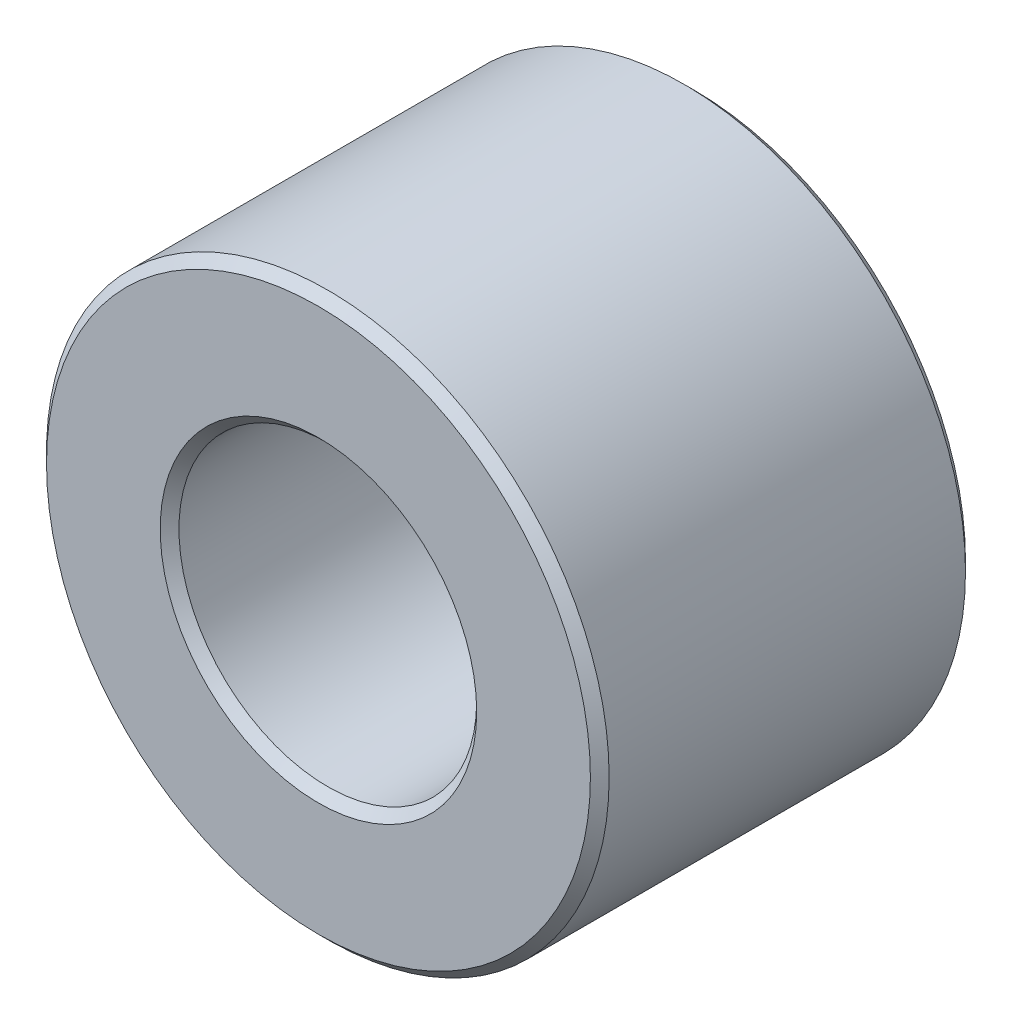
ISO-10303-21;
HEADER;
FILE_DESCRIPTION(('STEP AP214'),'2;1');
FILE_NAME('part.step','',(''),(''),'','','');
FILE_SCHEMA(('AUTOMOTIVE_DESIGN { 1 0 10303 214 1 1 1 1 }'));
ENDSEC;
DATA;
#1=APPLICATION_CONTEXT('core data for automotive mechanical design processes');
#2=APPLICATION_PROTOCOL_DEFINITION('international standard','automotive_design',2000,#1);
#3=PRODUCT_CONTEXT('',#1,'mechanical');
#4=PRODUCT('Part','Part','',(#3));
#5=PRODUCT_RELATED_PRODUCT_CATEGORY('part','',(#4));
#6=PRODUCT_DEFINITION_FORMATION('','',#4);
#7=PRODUCT_DEFINITION_CONTEXT('part definition',#1,'design');
#8=PRODUCT_DEFINITION('design','',#6,#7);
#9=PRODUCT_DEFINITION_SHAPE('','',#8);
#10=(LENGTH_UNIT() NAMED_UNIT(*) SI_UNIT(.MILLI.,.METRE.));
#11=(NAMED_UNIT(*) PLANE_ANGLE_UNIT() SI_UNIT($,.RADIAN.));
#12=(NAMED_UNIT(*) SI_UNIT($,.STERADIAN.) SOLID_ANGLE_UNIT());
#13=UNCERTAINTY_MEASURE_WITH_UNIT(LENGTH_MEASURE(1.E-05),#10,'distance_accuracy_value','');
#14=(GEOMETRIC_REPRESENTATION_CONTEXT(3) GLOBAL_UNCERTAINTY_ASSIGNED_CONTEXT((#13)) GLOBAL_UNIT_ASSIGNED_CONTEXT((#10,
#11,#12)) REPRESENTATION_CONTEXT('',''));
#15=CARTESIAN_POINT('',(0.,0.,0.));
#16=DIRECTION('',(0.,0.,1.));
#17=DIRECTION('',(1.,0.,0.));
#18=AXIS2_PLACEMENT_3D('',#15,#16,#17);
#19=CARTESIAN_POINT('',(0.,-1.65592377923915E-12,-1.05000000000006));
#20=DIRECTION('',(0.,0.,-1.));
#21=DIRECTION('',(0.,1.,0.));
#22=AXIS2_PLACEMENT_3D('',#19,#20,#21);
#23=CONICAL_SURFACE('',#22,2.95,0.785398163397491);
#24=CARTESIAN_POINT('',(0.,-1.65599638237972E-12,-1.00000000000007));
#25=DIRECTION('',(0.,0.,-1.));
#26=DIRECTION('',(1.,0.,0.));
#27=AXIS2_PLACEMENT_3D('',#24,#25,#26);
#28=CIRCLE('',#27,2.9);
#29=CARTESIAN_POINT('',(2.9,-1.65599638237972E-12,-1.00000000000007));
#30=VERTEX_POINT('',#29);
#31=EDGE_CURVE('E10',#30,#30,#28,.T.);
#32=ORIENTED_EDGE('',*,*,#31,.T.);
#33=EDGE_LOOP('',(#32));
#34=FACE_BOUND('',#33,.T.);
#35=CARTESIAN_POINT('',(0.,-1.65585117609857E-12,-1.10000000000006));
#36=DIRECTION('',(0.,0.,-1.));
#37=DIRECTION('',(1.,0.,0.));
#38=AXIS2_PLACEMENT_3D('',#35,#36,#37);
#39=CIRCLE('',#38,3.);
#40=CARTESIAN_POINT('',(3.,-1.65585117609857E-12,-1.10000000000006));
#41=VERTEX_POINT('',#40);
#42=EDGE_CURVE('E39',#41,#41,#39,.T.);
#43=ORIENTED_EDGE('',*,*,#42,.F.);
#44=EDGE_LOOP('',(#43));
#45=FACE_BOUND('',#44,.T.);
#46=ADVANCED_FACE('F15',(#34,#45),#23,.T.);
#47=CARTESIAN_POINT('',(0.,2.89999999999835,-1.00000000000006));
#48=DIRECTION('',(0.,0.,1.));
#49=DIRECTION('',(0.,-1.,0.));
#50=AXIS2_PLACEMENT_3D('',#47,#48,#49);
#51=PLANE('',#50);
#52=CARTESIAN_POINT('',(0.,-1.65599638237972E-12,-1.00000000000007));
#53=DIRECTION('',(0.,0.,-1.));
#54=DIRECTION('',(1.,0.,0.));
#55=AXIS2_PLACEMENT_3D('',#52,#53,#54);
#56=CIRCLE('',#55,1.6875);
#57=CARTESIAN_POINT('',(1.6875,-1.65599638237972E-12,-1.00000000000007));
#58=VERTEX_POINT('',#57);
#59=EDGE_CURVE('E23',#58,#58,#56,.T.);
#60=ORIENTED_EDGE('',*,*,#59,.T.);
#61=EDGE_LOOP('',(#60));
#62=FACE_BOUND('',#61,.T.);
#63=ORIENTED_EDGE('',*,*,#31,.F.);
#64=EDGE_LOOP('',(#63));
#65=FACE_BOUND('',#64,.T.);
#66=ADVANCED_FACE('F17',(#62,#65),#51,.T.);
#67=CARTESIAN_POINT('',(0.,-1.65592377923915E-12,-1.05000000000007));
#68=DIRECTION('',(0.,0.,1.));
#69=DIRECTION('',(0.,1.,0.));
#70=AXIS2_PLACEMENT_3D('',#67,#68,#69);
#71=CONICAL_SURFACE('',#70,1.6375,0.78539816339745);
#72=ORIENTED_EDGE('',*,*,#59,.F.);
#73=EDGE_LOOP('',(#72));
#74=FACE_BOUND('',#73,.T.);
#75=CARTESIAN_POINT('',(0.,-1.65585117609857E-12,-1.10000000000006));
#76=DIRECTION('',(0.,0.,-1.));
#77=DIRECTION('',(1.,0.,0.));
#78=AXIS2_PLACEMENT_3D('',#75,#76,#77);
#79=CIRCLE('',#78,1.5875);
#80=CARTESIAN_POINT('',(1.5875,-1.65585117609857E-12,-1.10000000000006));
#81=VERTEX_POINT('',#80);
#82=EDGE_CURVE('E32',#81,#81,#79,.T.);
#83=ORIENTED_EDGE('',*,*,#82,.T.);
#84=EDGE_LOOP('',(#83));
#85=FACE_BOUND('',#84,.T.);
#86=ADVANCED_FACE('F84',(#74,#85),#71,.F.);
#87=CARTESIAN_POINT('',(0.,-1.65447171642765E-12,-2.05000000000007));
#88=DIRECTION('',(0.,0.,-1.));
#89=DIRECTION('',(0.,1.,0.));
#90=AXIS2_PLACEMENT_3D('',#87,#88,#89);
#91=CYLINDRICAL_SURFACE('',#90,1.5875);
#92=ORIENTED_EDGE('',*,*,#82,.F.);
#93=EDGE_LOOP('',(#92));
#94=FACE_BOUND('',#93,.T.);
#95=CARTESIAN_POINT('',(0.,-1.65033333741488E-12,-4.90000000000007));
#96=DIRECTION('',(0.,0.,-1.));
#97=DIRECTION('',(1.,0.,0.));
#98=AXIS2_PLACEMENT_3D('',#95,#96,#97);
#99=CIRCLE('',#98,1.5875);
#100=CARTESIAN_POINT('',(1.5875,-1.65033333741488E-12,-4.90000000000007));
#101=VERTEX_POINT('',#100);
#102=EDGE_CURVE('E54',#101,#101,#99,.T.);
#103=ORIENTED_EDGE('',*,*,#102,.T.);
#104=EDGE_LOOP('',(#103));
#105=FACE_BOUND('',#104,.T.);
#106=ADVANCED_FACE('F64',(#94,#105),#91,.F.);
#107=CARTESIAN_POINT('',(0.,-1.65447171642765E-12,-2.05000000000006));
#108=DIRECTION('',(0.,0.,-1.));
#109=DIRECTION('',(0.,1.,0.));
#110=AXIS2_PLACEMENT_3D('',#107,#108,#109);
#111=CYLINDRICAL_SURFACE('',#110,3.);
#112=ORIENTED_EDGE('',*,*,#42,.T.);
#113=EDGE_LOOP('',(#112));
#114=FACE_BOUND('',#113,.T.);
#115=CARTESIAN_POINT('',(0.,-1.65033333741488E-12,-4.90000000000007));
#116=DIRECTION('',(0.,0.,-1.));
#117=DIRECTION('',(1.,0.,0.));
#118=AXIS2_PLACEMENT_3D('',#115,#116,#117);
#119=CIRCLE('',#118,3.);
#120=CARTESIAN_POINT('',(3.,-1.65033333741488E-12,-4.90000000000007));
#121=VERTEX_POINT('',#120);
#122=EDGE_CURVE('E42',#121,#121,#119,.T.);
#123=ORIENTED_EDGE('',*,*,#122,.F.);
#124=EDGE_LOOP('',(#123));
#125=FACE_BOUND('',#124,.T.);
#126=ADVANCED_FACE('F88',(#114,#125),#111,.T.);
#127=CARTESIAN_POINT('',(0.,-1.6502607342743E-12,-4.95000000000007));
#128=DIRECTION('',(0.,0.,1.));
#129=DIRECTION('',(0.,1.,0.));
#130=AXIS2_PLACEMENT_3D('',#127,#128,#129);
#131=CONICAL_SURFACE('',#130,2.95,0.785398163397491);
#132=CARTESIAN_POINT('',(0.,-1.65018813113373E-12,-5.00000000000006));
#133=DIRECTION('',(0.,0.,-1.));
#134=DIRECTION('',(1.,0.,0.));
#135=AXIS2_PLACEMENT_3D('',#132,#133,#134);
#136=CIRCLE('',#135,2.9);
#137=CARTESIAN_POINT('',(2.9,-1.65018813113373E-12,-5.00000000000006));
#138=VERTEX_POINT('',#137);
#139=EDGE_CURVE('E46',#138,#138,#136,.T.);
#140=ORIENTED_EDGE('',*,*,#139,.F.);
#141=EDGE_LOOP('',(#140));
#142=FACE_BOUND('',#141,.T.);
#143=ORIENTED_EDGE('',*,*,#122,.T.);
#144=EDGE_LOOP('',(#143));
#145=FACE_BOUND('',#144,.T.);
#146=ADVANCED_FACE('F75',(#142,#145),#131,.T.);
#147=CARTESIAN_POINT('',(0.,2.89999999999836,-5.00000000000006));
#148=DIRECTION('',(0.,0.,1.));
#149=DIRECTION('',(0.,-1.,0.));
#150=AXIS2_PLACEMENT_3D('',#147,#148,#149);
#151=PLANE('',#150);
#152=CARTESIAN_POINT('',(0.,-1.65018813113373E-12,-5.00000000000006));
#153=DIRECTION('',(0.,0.,-1.));
#154=DIRECTION('',(1.,0.,0.));
#155=AXIS2_PLACEMENT_3D('',#152,#153,#154);
#156=CIRCLE('',#155,1.6875);
#157=CARTESIAN_POINT('',(1.6875,-1.65018813113373E-12,-5.00000000000006));
#158=VERTEX_POINT('',#157);
#159=EDGE_CURVE('E50',#158,#158,#156,.T.);
#160=ORIENTED_EDGE('',*,*,#159,.F.);
#161=EDGE_LOOP('',(#160));
#162=FACE_BOUND('',#161,.T.);
#163=ORIENTED_EDGE('',*,*,#139,.T.);
#164=EDGE_LOOP('',(#163));
#165=FACE_BOUND('',#164,.T.);
#166=ADVANCED_FACE('F68',(#162,#165),#151,.F.);
#167=CARTESIAN_POINT('',(0.,-1.6502607342743E-12,-4.95000000000007));
#168=DIRECTION('',(0.,0.,-1.));
#169=DIRECTION('',(0.,1.,0.));
#170=AXIS2_PLACEMENT_3D('',#167,#168,#169);
#171=CONICAL_SURFACE('',#170,1.6375,0.78539816339745);
#172=ORIENTED_EDGE('',*,*,#159,.T.);
#173=EDGE_LOOP('',(#172));
#174=FACE_BOUND('',#173,.T.);
#175=ORIENTED_EDGE('',*,*,#102,.F.);
#176=EDGE_LOOP('',(#175));
#177=FACE_BOUND('',#176,.T.);
#178=ADVANCED_FACE('F66',(#174,#177),#171,.F.);
#179=CLOSED_SHELL('',(#46,#66,#86,#106,#126,#146,#166,#178));
#180=MANIFOLD_SOLID_BREP('B1',#179);
#181=ADVANCED_BREP_SHAPE_REPRESENTATION('',(#18,#180),#14);
#182=SHAPE_DEFINITION_REPRESENTATION(#9,#181);
ENDSEC;
END-ISO-10303-21;
